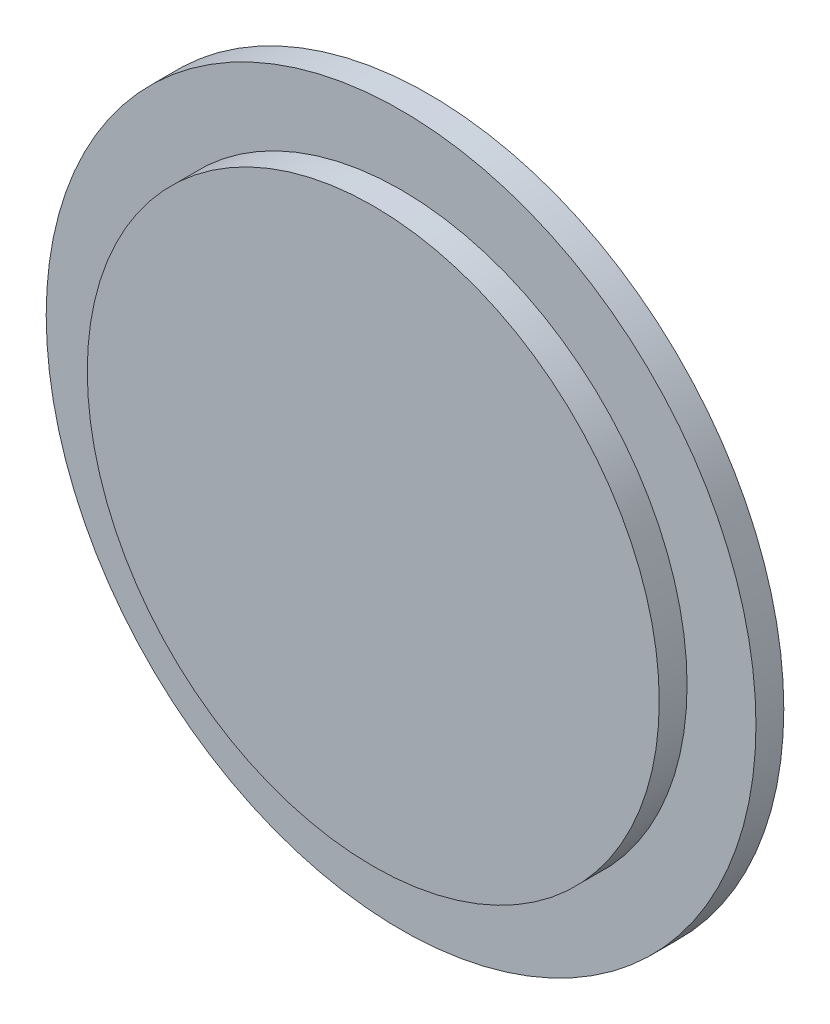
ISO-10303-21;
HEADER;
FILE_DESCRIPTION(('STEP AP214'),'2;1');
FILE_NAME('part.step','',(''),(''),'','','');
FILE_SCHEMA(('AUTOMOTIVE_DESIGN { 1 0 10303 214 1 1 1 1 }'));
ENDSEC;
DATA;
#1=APPLICATION_CONTEXT('core data for automotive mechanical design processes');
#2=APPLICATION_PROTOCOL_DEFINITION('international standard','automotive_design',2000,#1);
#3=PRODUCT_CONTEXT('',#1,'mechanical');
#4=PRODUCT('Part','Part','',(#3));
#5=PRODUCT_RELATED_PRODUCT_CATEGORY('part','',(#4));
#6=PRODUCT_DEFINITION_FORMATION('','',#4);
#7=PRODUCT_DEFINITION_CONTEXT('part definition',#1,'design');
#8=PRODUCT_DEFINITION('design','',#6,#7);
#9=PRODUCT_DEFINITION_SHAPE('','',#8);
#10=(LENGTH_UNIT() NAMED_UNIT(*) SI_UNIT(.MILLI.,.METRE.));
#11=(NAMED_UNIT(*) PLANE_ANGLE_UNIT() SI_UNIT($,.RADIAN.));
#12=(NAMED_UNIT(*) SI_UNIT($,.STERADIAN.) SOLID_ANGLE_UNIT());
#13=UNCERTAINTY_MEASURE_WITH_UNIT(LENGTH_MEASURE(1.E-05),#10,'distance_accuracy_value','');
#14=(GEOMETRIC_REPRESENTATION_CONTEXT(3) GLOBAL_UNCERTAINTY_ASSIGNED_CONTEXT((#13)) GLOBAL_UNIT_ASSIGNED_CONTEXT((#10,
#11,#12)) REPRESENTATION_CONTEXT('',''));
#15=CARTESIAN_POINT('',(0.,0.,0.));
#16=DIRECTION('',(0.,0.,1.));
#17=DIRECTION('',(1.,0.,0.));
#18=AXIS2_PLACEMENT_3D('',#15,#16,#17);
#19=CARTESIAN_POINT('',(0.,0.,2.));
#20=DIRECTION('',(0.,0.,-1.));
#21=DIRECTION('',(-1.,0.,0.));
#22=AXIS2_PLACEMENT_3D('',#19,#20,#21);
#23=CYLINDRICAL_SURFACE('',#22,25.5);
#24=CARTESIAN_POINT('',(0.,0.,2.));
#25=DIRECTION('',(0.,0.,1.));
#26=DIRECTION('',(1.,0.,0.));
#27=AXIS2_PLACEMENT_3D('',#24,#25,#26);
#28=CIRCLE('',#27,25.5);
#29=CARTESIAN_POINT('',(25.5,0.,2.));
#30=VERTEX_POINT('',#29);
#31=EDGE_CURVE('E45',#30,#30,#28,.T.);
#32=ORIENTED_EDGE('',*,*,#31,.F.);
#33=EDGE_LOOP('',(#32));
#34=FACE_BOUND('',#33,.T.);
#35=CARTESIAN_POINT('',(0.,0.,0.));
#36=DIRECTION('',(0.,0.,1.));
#37=DIRECTION('',(1.,0.,0.));
#38=AXIS2_PLACEMENT_3D('',#35,#36,#37);
#39=CIRCLE('',#38,25.5);
#40=CARTESIAN_POINT('',(25.5,0.,0.));
#41=VERTEX_POINT('',#40);
#42=EDGE_CURVE('E40',#41,#41,#39,.T.);
#43=ORIENTED_EDGE('',*,*,#42,.T.);
#44=EDGE_LOOP('',(#43));
#45=FACE_BOUND('',#44,.T.);
#46=ADVANCED_FACE('F37',(#34,#45),#23,.T.);
#47=CARTESIAN_POINT('',(0.,0.,2.));
#48=DIRECTION('',(0.,0.,1.));
#49=DIRECTION('',(1.,0.,0.));
#50=AXIS2_PLACEMENT_3D('',#47,#48,#49);
#51=PLANE('',#50);
#52=CARTESIAN_POINT('',(0.,0.,2.));
#53=DIRECTION('',(0.,0.,1.));
#54=DIRECTION('',(1.,0.,0.));
#55=AXIS2_PLACEMENT_3D('',#52,#53,#54);
#56=CIRCLE('',#55,20.55);
#57=CARTESIAN_POINT('',(20.55,0.,2.));
#58=VERTEX_POINT('',#57);
#59=EDGE_CURVE('E10',#58,#58,#56,.T.);
#60=ORIENTED_EDGE('',*,*,#59,.F.);
#61=EDGE_LOOP('',(#60));
#62=FACE_BOUND('',#61,.T.);
#63=ORIENTED_EDGE('',*,*,#31,.T.);
#64=EDGE_LOOP('',(#63));
#65=FACE_BOUND('',#64,.T.);
#66=ADVANCED_FACE('F65',(#62,#65),#51,.T.);
#67=CARTESIAN_POINT('',(0.,0.,0.));
#68=DIRECTION('',(0.,0.,1.));
#69=DIRECTION('',(1.,0.,0.));
#70=AXIS2_PLACEMENT_3D('',#67,#68,#69);
#71=PLANE('',#70);
#72=ORIENTED_EDGE('',*,*,#42,.F.);
#73=EDGE_LOOP('',(#72));
#74=FACE_BOUND('',#73,.T.);
#75=ADVANCED_FACE('F62',(#74),#71,.F.);
#76=CARTESIAN_POINT('',(0.,0.,4.));
#77=DIRECTION('',(0.,0.,-1.));
#78=DIRECTION('',(-1.,0.,0.));
#79=AXIS2_PLACEMENT_3D('',#76,#77,#78);
#80=CYLINDRICAL_SURFACE('',#79,20.55);
#81=CARTESIAN_POINT('',(0.,0.,4.));
#82=DIRECTION('',(0.,0.,1.));
#83=DIRECTION('',(1.,0.,0.));
#84=AXIS2_PLACEMENT_3D('',#81,#82,#83);
#85=CIRCLE('',#84,20.55);
#86=CARTESIAN_POINT('',(20.55,0.,4.));
#87=VERTEX_POINT('',#86);
#88=EDGE_CURVE('E52',#87,#87,#85,.T.);
#89=ORIENTED_EDGE('',*,*,#88,.F.);
#90=EDGE_LOOP('',(#89));
#91=FACE_BOUND('',#90,.T.);
#92=ORIENTED_EDGE('',*,*,#59,.T.);
#93=EDGE_LOOP('',(#92));
#94=FACE_BOUND('',#93,.T.);
#95=ADVANCED_FACE('F64',(#91,#94),#80,.T.);
#96=CARTESIAN_POINT('',(0.,0.,4.));
#97=DIRECTION('',(0.,0.,1.));
#98=DIRECTION('',(1.,0.,0.));
#99=AXIS2_PLACEMENT_3D('',#96,#97,#98);
#100=PLANE('',#99);
#101=ORIENTED_EDGE('',*,*,#88,.T.);
#102=EDGE_LOOP('',(#101));
#103=FACE_BOUND('',#102,.T.);
#104=ADVANCED_FACE('F70',(#103),#100,.T.);
#105=CLOSED_SHELL('',(#46,#66,#75,#95,#104));
#106=MANIFOLD_SOLID_BREP('B2',#105);
#107=ADVANCED_BREP_SHAPE_REPRESENTATION('',(#18,#106),#14);
#108=SHAPE_DEFINITION_REPRESENTATION(#9,#107);
ENDSEC;
END-ISO-10303-21;
